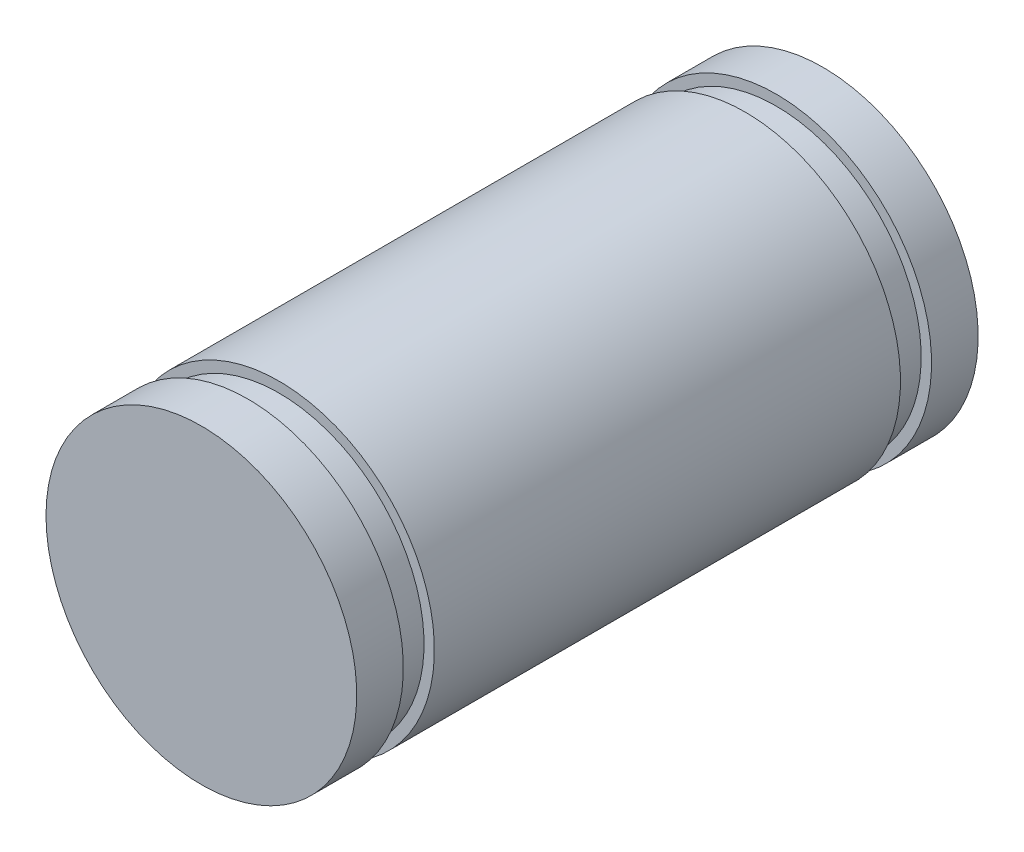
ISO-10303-21;
HEADER;
FILE_DESCRIPTION(('STEP AP214'),'2;1');
FILE_NAME('part.step','',(''),(''),'','','');
FILE_SCHEMA(('AUTOMOTIVE_DESIGN { 1 0 10303 214 1 1 1 1 }'));
ENDSEC;
DATA;
#1=APPLICATION_CONTEXT('core data for automotive mechanical design processes');
#2=APPLICATION_PROTOCOL_DEFINITION('international standard','automotive_design',2000,#1);
#3=PRODUCT_CONTEXT('',#1,'mechanical');
#4=PRODUCT('Part','Part','',(#3));
#5=PRODUCT_RELATED_PRODUCT_CATEGORY('part','',(#4));
#6=PRODUCT_DEFINITION_FORMATION('','',#4);
#7=PRODUCT_DEFINITION_CONTEXT('part definition',#1,'design');
#8=PRODUCT_DEFINITION('design','',#6,#7);
#9=PRODUCT_DEFINITION_SHAPE('','',#8);
#10=(LENGTH_UNIT() NAMED_UNIT(*) SI_UNIT(.MILLI.,.METRE.));
#11=(NAMED_UNIT(*) PLANE_ANGLE_UNIT() SI_UNIT($,.RADIAN.));
#12=(NAMED_UNIT(*) SI_UNIT($,.STERADIAN.) SOLID_ANGLE_UNIT());
#13=UNCERTAINTY_MEASURE_WITH_UNIT(LENGTH_MEASURE(1.E-05),#10,'distance_accuracy_value','');
#14=(GEOMETRIC_REPRESENTATION_CONTEXT(3) GLOBAL_UNCERTAINTY_ASSIGNED_CONTEXT((#13)) GLOBAL_UNIT_ASSIGNED_CONTEXT((#10,
#11,#12)) REPRESENTATION_CONTEXT('',''));
#15=CARTESIAN_POINT('',(0.,0.,0.));
#16=DIRECTION('',(0.,0.,1.));
#17=DIRECTION('',(1.,0.,0.));
#18=AXIS2_PLACEMENT_3D('',#15,#16,#17);
#19=CARTESIAN_POINT('',(0.,0.,12.));
#20=DIRECTION('',(0.,0.,1.));
#21=DIRECTION('',(1.,0.,0.));
#22=AXIS2_PLACEMENT_3D('',#19,#20,#21);
#23=PLANE('',#22);
#24=CARTESIAN_POINT('',(0.,0.,12.));
#25=DIRECTION('',(0.,0.,-1.));
#26=DIRECTION('',(-1.,0.,0.));
#27=AXIS2_PLACEMENT_3D('',#24,#25,#26);
#28=CIRCLE('',#27,3.);
#29=CARTESIAN_POINT('',(-3.,0.,12.));
#30=VERTEX_POINT('',#29);
#31=EDGE_CURVE('E18',#30,#30,#28,.T.);
#32=ORIENTED_EDGE('',*,*,#31,.F.);
#33=EDGE_LOOP('',(#32));
#34=FACE_BOUND('',#33,.T.);
#35=ADVANCED_FACE('F15',(#34),#23,.T.);
#36=CARTESIAN_POINT('',(0.,0.,0.));
#37=DIRECTION('',(0.,0.,1.));
#38=DIRECTION('',(1.,0.,0.));
#39=AXIS2_PLACEMENT_3D('',#36,#37,#38);
#40=PLANE('',#39);
#41=CARTESIAN_POINT('',(0.,0.,0.));
#42=DIRECTION('',(0.,0.,-1.));
#43=DIRECTION('',(-1.,0.,0.));
#44=AXIS2_PLACEMENT_3D('',#41,#42,#43);
#45=CIRCLE('',#44,3.);
#46=CARTESIAN_POINT('',(-3.,0.,0.));
#47=VERTEX_POINT('',#46);
#48=EDGE_CURVE('E46',#47,#47,#45,.F.);
#49=ORIENTED_EDGE('',*,*,#48,.F.);
#50=EDGE_LOOP('',(#49));
#51=FACE_BOUND('',#50,.T.);
#52=ADVANCED_FACE('F56',(#51),#40,.F.);
#53=CARTESIAN_POINT('',(0.,0.,12.));
#54=DIRECTION('',(0.,0.,-1.));
#55=DIRECTION('',(-1.,0.,0.));
#56=AXIS2_PLACEMENT_3D('',#53,#54,#55);
#57=CYLINDRICAL_SURFACE('',#56,3.);
#58=CARTESIAN_POINT('',(0.,0.,11.1));
#59=DIRECTION('',(0.,0.,-1.));
#60=DIRECTION('',(-1.,0.,0.));
#61=AXIS2_PLACEMENT_3D('',#58,#59,#60);
#62=CIRCLE('',#61,3.);
#63=CARTESIAN_POINT('',(-3.,0.,11.1));
#64=VERTEX_POINT('',#63);
#65=EDGE_CURVE('E44',#64,#64,#62,.F.);
#66=ORIENTED_EDGE('',*,*,#65,.T.);
#67=EDGE_LOOP('',(#66));
#68=FACE_BOUND('',#67,.T.);
#69=ORIENTED_EDGE('',*,*,#31,.T.);
#70=EDGE_LOOP('',(#69));
#71=FACE_BOUND('',#70,.T.);
#72=ADVANCED_FACE('F53',(#68,#71),#57,.T.);
#73=CARTESIAN_POINT('',(0.,0.,12.));
#74=DIRECTION('',(0.,0.,-1.));
#75=DIRECTION('',(-1.,0.,0.));
#76=AXIS2_PLACEMENT_3D('',#73,#74,#75);
#77=CYLINDRICAL_SURFACE('',#76,3.);
#78=ORIENTED_EDGE('',*,*,#48,.T.);
#79=EDGE_LOOP('',(#78));
#80=FACE_BOUND('',#79,.T.);
#81=CARTESIAN_POINT('',(0.,0.,0.9));
#82=DIRECTION('',(0.,0.,-1.));
#83=DIRECTION('',(-1.,0.,0.));
#84=AXIS2_PLACEMENT_3D('',#81,#82,#83);
#85=CIRCLE('',#84,3.);
#86=CARTESIAN_POINT('',(-3.,0.,0.9));
#87=VERTEX_POINT('',#86);
#88=EDGE_CURVE('E41',#87,#87,#85,.T.);
#89=ORIENTED_EDGE('',*,*,#88,.T.);
#90=EDGE_LOOP('',(#89));
#91=FACE_BOUND('',#90,.T.);
#92=ADVANCED_FACE('F92',(#80,#91),#77,.T.);
#93=CARTESIAN_POINT('',(-3.,0.,11.1));
#94=DIRECTION('',(0.,0.,1.));
#95=DIRECTION('',(1.,0.,0.));
#96=AXIS2_PLACEMENT_3D('',#93,#94,#95);
#97=PLANE('',#96);
#98=ORIENTED_EDGE('',*,*,#65,.F.);
#99=EDGE_LOOP('',(#98));
#100=FACE_BOUND('',#99,.T.);
#101=CARTESIAN_POINT('',(0.,0.,11.1));
#102=DIRECTION('',(0.,0.,-1.));
#103=DIRECTION('',(-1.,0.,0.));
#104=AXIS2_PLACEMENT_3D('',#101,#102,#103);
#105=CIRCLE('',#104,2.8);
#106=CARTESIAN_POINT('',(-2.8,0.,11.1));
#107=VERTEX_POINT('',#106);
#108=EDGE_CURVE('E38',#107,#107,#105,.T.);
#109=ORIENTED_EDGE('',*,*,#108,.F.);
#110=EDGE_LOOP('',(#109));
#111=FACE_BOUND('',#110,.T.);
#112=ADVANCED_FACE('F88',(#100,#111),#97,.F.);
#113=CARTESIAN_POINT('',(-3.,0.,0.9));
#114=DIRECTION('',(0.,0.,-1.));
#115=DIRECTION('',(-1.,0.,0.));
#116=AXIS2_PLACEMENT_3D('',#113,#114,#115);
#117=PLANE('',#116);
#118=CARTESIAN_POINT('',(0.,0.,0.9));
#119=DIRECTION('',(0.,0.,-1.));
#120=DIRECTION('',(-1.,0.,0.));
#121=AXIS2_PLACEMENT_3D('',#118,#119,#120);
#122=CIRCLE('',#121,2.8);
#123=CARTESIAN_POINT('',(-2.8,0.,0.9));
#124=VERTEX_POINT('',#123);
#125=EDGE_CURVE('E35',#124,#124,#122,.F.);
#126=ORIENTED_EDGE('',*,*,#125,.F.);
#127=EDGE_LOOP('',(#126));
#128=FACE_BOUND('',#127,.T.);
#129=ORIENTED_EDGE('',*,*,#88,.F.);
#130=EDGE_LOOP('',(#129));
#131=FACE_BOUND('',#130,.T.);
#132=ADVANCED_FACE('F84',(#128,#131),#117,.F.);
#133=CARTESIAN_POINT('',(0.,0.,-2.24322429185041));
#134=DIRECTION('',(0.,0.,-1.));
#135=DIRECTION('',(-1.,0.,0.));
#136=AXIS2_PLACEMENT_3D('',#133,#134,#135);
#137=CYLINDRICAL_SURFACE('',#136,2.8);
#138=CARTESIAN_POINT('',(0.,0.,10.5));
#139=DIRECTION('',(0.,0.,-1.));
#140=DIRECTION('',(-1.,0.,0.));
#141=AXIS2_PLACEMENT_3D('',#138,#139,#140);
#142=CIRCLE('',#141,2.8);
#143=CARTESIAN_POINT('',(-2.8,0.,10.5));
#144=VERTEX_POINT('',#143);
#145=EDGE_CURVE('E32',#144,#144,#142,.F.);
#146=ORIENTED_EDGE('',*,*,#145,.T.);
#147=EDGE_LOOP('',(#146));
#148=FACE_BOUND('',#147,.T.);
#149=ORIENTED_EDGE('',*,*,#108,.T.);
#150=EDGE_LOOP('',(#149));
#151=FACE_BOUND('',#150,.T.);
#152=ADVANCED_FACE('F80',(#148,#151),#137,.T.);
#153=CARTESIAN_POINT('',(0.,0.,-2.24322429185041));
#154=DIRECTION('',(0.,0.,-1.));
#155=DIRECTION('',(-1.,0.,0.));
#156=AXIS2_PLACEMENT_3D('',#153,#154,#155);
#157=CYLINDRICAL_SURFACE('',#156,2.8);
#158=ORIENTED_EDGE('',*,*,#125,.T.);
#159=EDGE_LOOP('',(#158));
#160=FACE_BOUND('',#159,.T.);
#161=CARTESIAN_POINT('',(0.,0.,1.5));
#162=DIRECTION('',(0.,0.,-1.));
#163=DIRECTION('',(-1.,0.,0.));
#164=AXIS2_PLACEMENT_3D('',#161,#162,#163);
#165=CIRCLE('',#164,2.8);
#166=CARTESIAN_POINT('',(-2.8,0.,1.5));
#167=VERTEX_POINT('',#166);
#168=EDGE_CURVE('E27',#167,#167,#165,.T.);
#169=ORIENTED_EDGE('',*,*,#168,.T.);
#170=EDGE_LOOP('',(#169));
#171=FACE_BOUND('',#170,.T.);
#172=ADVANCED_FACE('F76',(#160,#171),#157,.T.);
#173=CARTESIAN_POINT('',(-3.,0.,10.5));
#174=DIRECTION('',(0.,0.,-1.));
#175=DIRECTION('',(-1.,0.,0.));
#176=AXIS2_PLACEMENT_3D('',#173,#174,#175);
#177=PLANE('',#176);
#178=ORIENTED_EDGE('',*,*,#145,.F.);
#179=EDGE_LOOP('',(#178));
#180=FACE_BOUND('',#179,.T.);
#181=CARTESIAN_POINT('',(0.,0.,10.5));
#182=DIRECTION('',(0.,0.,-1.));
#183=DIRECTION('',(-1.,0.,0.));
#184=AXIS2_PLACEMENT_3D('',#181,#182,#183);
#185=CIRCLE('',#184,3.);
#186=CARTESIAN_POINT('',(-3.,0.,10.5));
#187=VERTEX_POINT('',#186);
#188=EDGE_CURVE('E22',#187,#187,#185,.T.);
#189=ORIENTED_EDGE('',*,*,#188,.F.);
#190=EDGE_LOOP('',(#189));
#191=FACE_BOUND('',#190,.T.);
#192=ADVANCED_FACE('F69',(#180,#191),#177,.F.);
#193=CARTESIAN_POINT('',(-3.,0.,1.5));
#194=DIRECTION('',(0.,0.,1.));
#195=DIRECTION('',(1.,0.,0.));
#196=AXIS2_PLACEMENT_3D('',#193,#194,#195);
#197=PLANE('',#196);
#198=CARTESIAN_POINT('',(0.,0.,1.5));
#199=DIRECTION('',(0.,0.,-1.));
#200=DIRECTION('',(-1.,0.,0.));
#201=AXIS2_PLACEMENT_3D('',#198,#199,#200);
#202=CIRCLE('',#201,3.);
#203=CARTESIAN_POINT('',(-3.,0.,1.5));
#204=VERTEX_POINT('',#203);
#205=EDGE_CURVE('E10',#204,#204,#202,.F.);
#206=ORIENTED_EDGE('',*,*,#205,.F.);
#207=EDGE_LOOP('',(#206));
#208=FACE_BOUND('',#207,.T.);
#209=ORIENTED_EDGE('',*,*,#168,.F.);
#210=EDGE_LOOP('',(#209));
#211=FACE_BOUND('',#210,.T.);
#212=ADVANCED_FACE('F64',(#208,#211),#197,.F.);
#213=CARTESIAN_POINT('',(0.,0.,12.));
#214=DIRECTION('',(0.,0.,-1.));
#215=DIRECTION('',(-1.,0.,0.));
#216=AXIS2_PLACEMENT_3D('',#213,#214,#215);
#217=CYLINDRICAL_SURFACE('',#216,3.);
#218=ORIENTED_EDGE('',*,*,#205,.T.);
#219=EDGE_LOOP('',(#218));
#220=FACE_BOUND('',#219,.T.);
#221=ORIENTED_EDGE('',*,*,#188,.T.);
#222=EDGE_LOOP('',(#221));
#223=FACE_BOUND('',#222,.T.);
#224=ADVANCED_FACE('F62',(#220,#223),#217,.T.);
#225=CLOSED_SHELL('',(#35,#52,#72,#92,#112,#132,#152,#172,#192,#212,#224));
#226=MANIFOLD_SOLID_BREP('B1',#225);
#227=ADVANCED_BREP_SHAPE_REPRESENTATION('',(#18,#226),#14);
#228=SHAPE_DEFINITION_REPRESENTATION(#9,#227);
ENDSEC;
END-ISO-10303-21;
